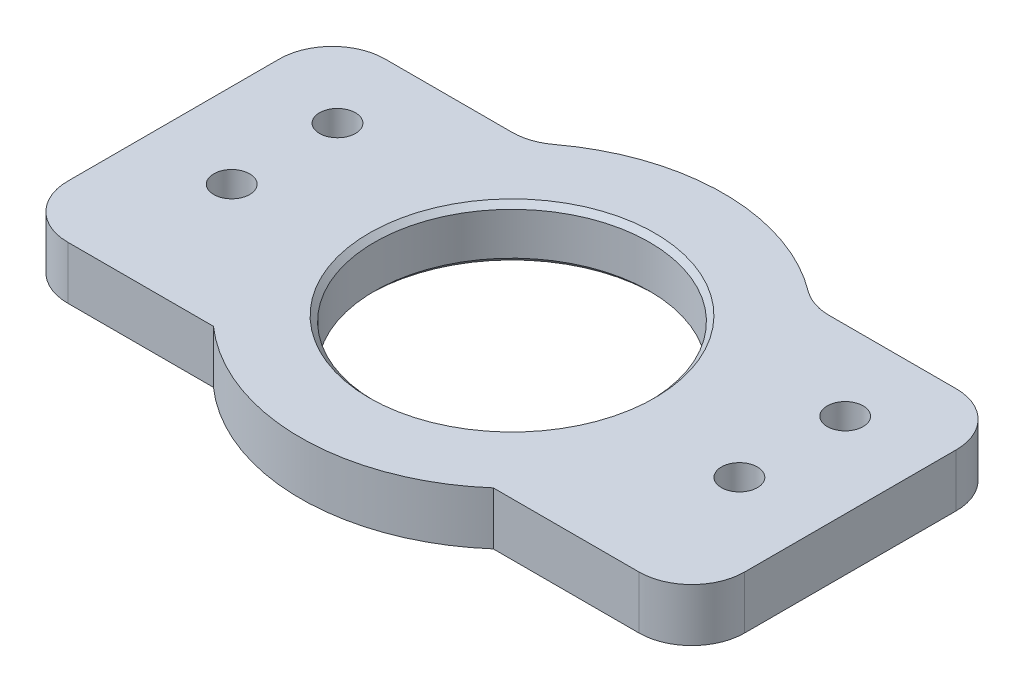
ISO-10303-21;
HEADER;
FILE_DESCRIPTION(('STEP AP214'),'2;1');
FILE_NAME('part.step','',(''),(''),'','','');
FILE_SCHEMA(('AUTOMOTIVE_DESIGN { 1 0 10303 214 1 1 1 1 }'));
ENDSEC;
DATA;
#1=APPLICATION_CONTEXT('core data for automotive mechanical design processes');
#2=APPLICATION_PROTOCOL_DEFINITION('international standard','automotive_design',2000,#1);
#3=PRODUCT_CONTEXT('',#1,'mechanical');
#4=PRODUCT('Part','Part','',(#3));
#5=PRODUCT_RELATED_PRODUCT_CATEGORY('part','',(#4));
#6=PRODUCT_DEFINITION_FORMATION('','',#4);
#7=PRODUCT_DEFINITION_CONTEXT('part definition',#1,'design');
#8=PRODUCT_DEFINITION('design','',#6,#7);
#9=PRODUCT_DEFINITION_SHAPE('','',#8);
#10=(LENGTH_UNIT() NAMED_UNIT(*) SI_UNIT(.MILLI.,.METRE.));
#11=(NAMED_UNIT(*) PLANE_ANGLE_UNIT() SI_UNIT($,.RADIAN.));
#12=(NAMED_UNIT(*) SI_UNIT($,.STERADIAN.) SOLID_ANGLE_UNIT());
#13=UNCERTAINTY_MEASURE_WITH_UNIT(LENGTH_MEASURE(1.E-05),#10,'distance_accuracy_value','');
#14=(GEOMETRIC_REPRESENTATION_CONTEXT(3) GLOBAL_UNCERTAINTY_ASSIGNED_CONTEXT((#13)) GLOBAL_UNIT_ASSIGNED_CONTEXT((#10,
#11,#12)) REPRESENTATION_CONTEXT('',''));
#15=CARTESIAN_POINT('',(0.,0.,0.));
#16=DIRECTION('',(0.,0.,1.));
#17=DIRECTION('',(1.,0.,0.));
#18=AXIS2_PLACEMENT_3D('',#15,#16,#17);
#19=CARTESIAN_POINT('',(0.,5.,0.));
#20=DIRECTION('',(1.,0.,0.));
#21=DIRECTION('',(0.,0.,-1.));
#22=AXIS2_PLACEMENT_3D('',#19,#20,#21);
#23=PLANE('',#22);
#24=DIRECTION('',(0.,0.,1.));
#25=VECTOR('',#24,1.);
#26=CARTESIAN_POINT('',(0.,0.,0.));
#27=LINE('',#26,#25);
#28=CARTESIAN_POINT('',(0.,0.,-25.));
#29=VERTEX_POINT('',#28);
#30=CARTESIAN_POINT('',(0.,0.,-5.));
#31=VERTEX_POINT('',#30);
#32=EDGE_CURVE('E190',#29,#31,#27,.T.);
#33=ORIENTED_EDGE('',*,*,#32,.T.);
#34=DIRECTION('',(0.,-1.,0.));
#35=VECTOR('',#34,1.);
#36=CARTESIAN_POINT('',(0.,5.,-5.));
#37=LINE('',#36,#35);
#38=CARTESIAN_POINT('',(0.,5.,-5.));
#39=VERTEX_POINT('',#38);
#40=EDGE_CURVE('E243',#31,#39,#37,.F.);
#41=ORIENTED_EDGE('',*,*,#40,.T.);
#42=DIRECTION('',(0.,0.,1.));
#43=VECTOR('',#42,1.);
#44=CARTESIAN_POINT('',(0.,5.,0.));
#45=LINE('',#44,#43);
#46=CARTESIAN_POINT('',(0.,5.,-25.));
#47=VERTEX_POINT('',#46);
#48=EDGE_CURVE('E161',#47,#39,#45,.T.);
#49=ORIENTED_EDGE('',*,*,#48,.F.);
#50=DIRECTION('',(0.,-1.,0.));
#51=VECTOR('',#50,1.);
#52=CARTESIAN_POINT('',(0.,5.,-25.));
#53=LINE('',#52,#51);
#54=EDGE_CURVE('E240',#47,#29,#53,.T.);
#55=ORIENTED_EDGE('',*,*,#54,.T.);
#56=EDGE_LOOP('',(#33,#41,#49,#55));
#57=FACE_BOUND('',#56,.T.);
#58=ADVANCED_FACE('F45',(#57),#23,.F.);
#59=CARTESIAN_POINT('',(0.,5.,0.));
#60=DIRECTION('',(0.,0.,-1.));
#61=DIRECTION('',(-1.,0.,0.));
#62=AXIS2_PLACEMENT_3D('',#59,#60,#61);
#63=PLANE('',#62);
#64=DIRECTION('',(1.,0.,0.));
#65=VECTOR('',#64,1.);
#66=CARTESIAN_POINT('',(0.,5.,0.));
#67=LINE('',#66,#65);
#68=CARTESIAN_POINT('',(5.,5.,0.));
#69=VERTEX_POINT('',#68);
#70=CARTESIAN_POINT('',(18.771243444677,5.,0.));
#71=VERTEX_POINT('',#70);
#72=EDGE_CURVE('E147',#69,#71,#67,.T.);
#73=ORIENTED_EDGE('',*,*,#72,.F.);
#74=DIRECTION('',(0.,-1.,0.));
#75=VECTOR('',#74,1.);
#76=CARTESIAN_POINT('',(5.,5.,0.));
#77=LINE('',#76,#75);
#78=CARTESIAN_POINT('',(5.,0.,0.));
#79=VERTEX_POINT('',#78);
#80=EDGE_CURVE('E238',#69,#79,#77,.T.);
#81=ORIENTED_EDGE('',*,*,#80,.T.);
#82=DIRECTION('',(1.,0.,0.));
#83=VECTOR('',#82,1.);
#84=CARTESIAN_POINT('',(0.,0.,0.));
#85=LINE('',#84,#83);
#86=CARTESIAN_POINT('',(18.771243444677,0.,0.));
#87=VERTEX_POINT('',#86);
#88=EDGE_CURVE('E167',#79,#87,#85,.T.);
#89=ORIENTED_EDGE('',*,*,#88,.T.);
#90=DIRECTION('',(0.,-1.,0.));
#91=VECTOR('',#90,1.);
#92=CARTESIAN_POINT('',(18.771243444677,5.,0.));
#93=LINE('',#92,#91);
#94=EDGE_CURVE('E164',#71,#87,#93,.T.);
#95=ORIENTED_EDGE('',*,*,#94,.F.);
#96=EDGE_LOOP('',(#73,#81,#89,#95));
#97=FACE_BOUND('',#96,.T.);
#98=ADVANCED_FACE('F165',(#97),#63,.F.);
#99=CARTESIAN_POINT('',(32.,5.,-15.));
#100=DIRECTION('',(0.,-1.,0.));
#101=DIRECTION('',(0.,0.,-1.));
#102=AXIS2_PLACEMENT_3D('',#99,#100,#101);
#103=CYLINDRICAL_SURFACE('',#102,20.);
#104=CARTESIAN_POINT('',(32.,0.,-15.));
#105=DIRECTION('',(0.,1.,0.));
#106=DIRECTION('',(0.,0.,1.));
#107=AXIS2_PLACEMENT_3D('',#104,#105,#106);
#108=CIRCLE('',#107,20.);
#109=CARTESIAN_POINT('',(45.228756555323,0.,0.));
#110=VERTEX_POINT('',#109);
#111=EDGE_CURVE('E195',#87,#110,#108,.T.);
#112=ORIENTED_EDGE('',*,*,#111,.T.);
#113=DIRECTION('',(0.,-1.,0.));
#114=VECTOR('',#113,1.);
#115=CARTESIAN_POINT('',(45.228756555323,5.,0.));
#116=LINE('',#115,#114);
#117=CARTESIAN_POINT('',(45.228756555323,5.,0.));
#118=VERTEX_POINT('',#117);
#119=EDGE_CURVE('E171',#118,#110,#116,.T.);
#120=ORIENTED_EDGE('',*,*,#119,.F.);
#121=CARTESIAN_POINT('',(32.,5.,-15.));
#122=DIRECTION('',(0.,1.,0.));
#123=DIRECTION('',(0.,0.,1.));
#124=AXIS2_PLACEMENT_3D('',#121,#122,#123);
#125=CIRCLE('',#124,20.);
#126=EDGE_CURVE('E153',#71,#118,#125,.T.);
#127=ORIENTED_EDGE('',*,*,#126,.F.);
#128=ORIENTED_EDGE('',*,*,#94,.T.);
#129=EDGE_LOOP('',(#112,#120,#127,#128));
#130=FACE_BOUND('',#129,.T.);
#131=ADVANCED_FACE('F173',(#130),#103,.T.);
#132=CARTESIAN_POINT('',(45.228756555323,5.,0.));
#133=DIRECTION('',(0.,0.,-1.));
#134=DIRECTION('',(-1.,0.,0.));
#135=AXIS2_PLACEMENT_3D('',#132,#133,#134);
#136=PLANE('',#135);
#137=DIRECTION('',(1.,0.,0.));
#138=VECTOR('',#137,1.);
#139=CARTESIAN_POINT('',(45.228756555323,0.,0.));
#140=LINE('',#139,#138);
#141=CARTESIAN_POINT('',(59.,0.,0.));
#142=VERTEX_POINT('',#141);
#143=EDGE_CURVE('E197',#110,#142,#140,.T.);
#144=ORIENTED_EDGE('',*,*,#143,.T.);
#145=DIRECTION('',(0.,-1.,0.));
#146=VECTOR('',#145,1.);
#147=CARTESIAN_POINT('',(59.,5.,0.));
#148=LINE('',#147,#146);
#149=CARTESIAN_POINT('',(59.,5.,0.));
#150=VERTEX_POINT('',#149);
#151=EDGE_CURVE('E236',#142,#150,#148,.F.);
#152=ORIENTED_EDGE('',*,*,#151,.T.);
#153=DIRECTION('',(1.,0.,0.));
#154=VECTOR('',#153,1.);
#155=CARTESIAN_POINT('',(45.228756555323,5.,0.));
#156=LINE('',#155,#154);
#157=EDGE_CURVE('E176',#118,#150,#156,.T.);
#158=ORIENTED_EDGE('',*,*,#157,.F.);
#159=ORIENTED_EDGE('',*,*,#119,.T.);
#160=EDGE_LOOP('',(#144,#152,#158,#159));
#161=FACE_BOUND('',#160,.T.);
#162=ADVANCED_FACE('F419',(#161),#136,.F.);
#163=CARTESIAN_POINT('',(64.,5.,0.));
#164=DIRECTION('',(-1.,0.,0.));
#165=DIRECTION('',(0.,0.,1.));
#166=AXIS2_PLACEMENT_3D('',#163,#164,#165);
#167=PLANE('',#166);
#168=DIRECTION('',(0.,0.,-1.));
#169=VECTOR('',#168,1.);
#170=CARTESIAN_POINT('',(64.,0.,0.));
#171=LINE('',#170,#169);
#172=CARTESIAN_POINT('',(64.,0.,-5.));
#173=VERTEX_POINT('',#172);
#174=CARTESIAN_POINT('',(64.,0.,-25.));
#175=VERTEX_POINT('',#174);
#176=EDGE_CURVE('E200',#173,#175,#171,.T.);
#177=ORIENTED_EDGE('',*,*,#176,.T.);
#178=DIRECTION('',(0.,-1.,0.));
#179=VECTOR('',#178,1.);
#180=CARTESIAN_POINT('',(64.,5.,-25.));
#181=LINE('',#180,#179);
#182=CARTESIAN_POINT('',(64.,5.,-25.));
#183=VERTEX_POINT('',#182);
#184=EDGE_CURVE('E227',#175,#183,#181,.F.);
#185=ORIENTED_EDGE('',*,*,#184,.T.);
#186=DIRECTION('',(0.,0.,-1.));
#187=VECTOR('',#186,1.);
#188=CARTESIAN_POINT('',(64.,5.,0.));
#189=LINE('',#188,#187);
#190=CARTESIAN_POINT('',(64.,5.,-5.));
#191=VERTEX_POINT('',#190);
#192=EDGE_CURVE('E178',#191,#183,#189,.T.);
#193=ORIENTED_EDGE('',*,*,#192,.F.);
#194=DIRECTION('',(0.,-1.,0.));
#195=VECTOR('',#194,1.);
#196=CARTESIAN_POINT('',(64.,5.,-5.));
#197=LINE('',#196,#195);
#198=EDGE_CURVE('E224',#191,#173,#197,.T.);
#199=ORIENTED_EDGE('',*,*,#198,.T.);
#200=EDGE_LOOP('',(#177,#185,#193,#199));
#201=FACE_BOUND('',#200,.T.);
#202=ADVANCED_FACE('F416',(#201),#167,.F.);
#203=CARTESIAN_POINT('',(45.228756555323,5.,-30.));
#204=DIRECTION('',(0.,0.,1.));
#205=DIRECTION('',(1.,0.,0.));
#206=AXIS2_PLACEMENT_3D('',#203,#204,#205);
#207=PLANE('',#206);
#208=DIRECTION('',(-1.,0.,0.));
#209=VECTOR('',#208,1.);
#210=CARTESIAN_POINT('',(45.228756555323,5.,-30.));
#211=LINE('',#210,#209);
#212=CARTESIAN_POINT('',(59.,5.,-30.));
#213=VERTEX_POINT('',#212);
#214=CARTESIAN_POINT('',(47.,5.,-30.));
#215=VERTEX_POINT('',#214);
#216=EDGE_CURVE('E183',#213,#215,#211,.T.);
#217=ORIENTED_EDGE('',*,*,#216,.F.);
#218=DIRECTION('',(0.,-1.,0.));
#219=VECTOR('',#218,1.);
#220=CARTESIAN_POINT('',(59.,5.,-30.));
#221=LINE('',#220,#219);
#222=CARTESIAN_POINT('',(59.,0.,-30.));
#223=VERTEX_POINT('',#222);
#224=EDGE_CURVE('E213',#213,#223,#221,.T.);
#225=ORIENTED_EDGE('',*,*,#224,.T.);
#226=DIRECTION('',(-1.,0.,0.));
#227=VECTOR('',#226,1.);
#228=CARTESIAN_POINT('',(45.228756555323,0.,-30.));
#229=LINE('',#228,#227);
#230=CARTESIAN_POINT('',(47.,0.,-30.));
#231=VERTEX_POINT('',#230);
#232=EDGE_CURVE('E203',#223,#231,#229,.T.);
#233=ORIENTED_EDGE('',*,*,#232,.T.);
#234=DIRECTION('',(0.,1.,0.));
#235=VECTOR('',#234,1.);
#236=CARTESIAN_POINT('',(47.,5.,-30.));
#237=LINE('',#236,#235);
#238=EDGE_CURVE('E170',#231,#215,#237,.T.);
#239=ORIENTED_EDGE('',*,*,#238,.T.);
#240=EDGE_LOOP('',(#217,#225,#233,#239));
#241=FACE_BOUND('',#240,.T.);
#242=ADVANCED_FACE('F314',(#241),#207,.F.);
#243=CARTESIAN_POINT('',(32.,5.,-15.));
#244=DIRECTION('',(0.,-1.,0.));
#245=DIRECTION('',(0.,0.,-1.));
#246=AXIS2_PLACEMENT_3D('',#243,#244,#245);
#247=CYLINDRICAL_SURFACE('',#246,20.);
#248=CARTESIAN_POINT('',(32.,5.,-15.));
#249=DIRECTION('',(0.,1.,0.));
#250=DIRECTION('',(0.,0.,1.));
#251=AXIS2_PLACEMENT_3D('',#248,#249,#250);
#252=CIRCLE('',#251,20.);
#253=CARTESIAN_POINT('',(44.,5.,-31.));
#254=VERTEX_POINT('',#253);
#255=CARTESIAN_POINT('',(20.,5.,-31.));
#256=VERTEX_POINT('',#255);
#257=EDGE_CURVE('E186',#254,#256,#252,.T.);
#258=ORIENTED_EDGE('',*,*,#257,.F.);
#259=DIRECTION('',(0.,-1.,0.));
#260=VECTOR('',#259,1.);
#261=CARTESIAN_POINT('',(44.,5.,-31.));
#262=LINE('',#261,#260);
#263=CARTESIAN_POINT('',(44.,0.,-31.));
#264=VERTEX_POINT('',#263);
#265=EDGE_CURVE('E251',#254,#264,#262,.T.);
#266=ORIENTED_EDGE('',*,*,#265,.T.);
#267=CARTESIAN_POINT('',(32.,0.,-15.));
#268=DIRECTION('',(0.,1.,0.));
#269=DIRECTION('',(0.,0.,1.));
#270=AXIS2_PLACEMENT_3D('',#267,#268,#269);
#271=CIRCLE('',#270,20.);
#272=CARTESIAN_POINT('',(20.,0.,-31.));
#273=VERTEX_POINT('',#272);
#274=EDGE_CURVE('E206',#264,#273,#271,.T.);
#275=ORIENTED_EDGE('',*,*,#274,.T.);
#276=DIRECTION('',(0.,-1.,0.));
#277=VECTOR('',#276,1.);
#278=CARTESIAN_POINT('',(20.,5.,-31.));
#279=LINE('',#278,#277);
#280=EDGE_CURVE('E249',#273,#256,#279,.F.);
#281=ORIENTED_EDGE('',*,*,#280,.T.);
#282=EDGE_LOOP('',(#258,#266,#275,#281));
#283=FACE_BOUND('',#282,.T.);
#284=ADVANCED_FACE('F322',(#283),#247,.T.);
#285=CARTESIAN_POINT('',(0.,5.,-30.));
#286=DIRECTION('',(0.,0.,1.));
#287=DIRECTION('',(1.,0.,0.));
#288=AXIS2_PLACEMENT_3D('',#285,#286,#287);
#289=PLANE('',#288);
#290=DIRECTION('',(-1.,0.,0.));
#291=VECTOR('',#290,1.);
#292=CARTESIAN_POINT('',(0.,0.,-30.));
#293=LINE('',#292,#291);
#294=CARTESIAN_POINT('',(17.,0.,-30.));
#295=VERTEX_POINT('',#294);
#296=CARTESIAN_POINT('',(5.,0.,-30.));
#297=VERTEX_POINT('',#296);
#298=EDGE_CURVE('E209',#295,#297,#293,.T.);
#299=ORIENTED_EDGE('',*,*,#298,.T.);
#300=DIRECTION('',(0.,-1.,0.));
#301=VECTOR('',#300,1.);
#302=CARTESIAN_POINT('',(5.,5.,-30.));
#303=LINE('',#302,#301);
#304=CARTESIAN_POINT('',(5.,5.,-30.));
#305=VERTEX_POINT('',#304);
#306=EDGE_CURVE('E61',#297,#305,#303,.F.);
#307=ORIENTED_EDGE('',*,*,#306,.T.);
#308=DIRECTION('',(-1.,0.,0.));
#309=VECTOR('',#308,1.);
#310=CARTESIAN_POINT('',(0.,5.,-30.));
#311=LINE('',#310,#309);
#312=CARTESIAN_POINT('',(17.,5.,-30.));
#313=VERTEX_POINT('',#312);
#314=EDGE_CURVE('E188',#313,#305,#311,.T.);
#315=ORIENTED_EDGE('',*,*,#314,.F.);
#316=DIRECTION('',(0.,1.,0.));
#317=VECTOR('',#316,1.);
#318=CARTESIAN_POINT('',(17.,0.,-30.));
#319=LINE('',#318,#317);
#320=EDGE_CURVE('E245',#313,#295,#319,.F.);
#321=ORIENTED_EDGE('',*,*,#320,.T.);
#322=EDGE_LOOP('',(#299,#307,#315,#321));
#323=FACE_BOUND('',#322,.T.);
#324=ADVANCED_FACE('F328',(#323),#289,.F.);
#325=CARTESIAN_POINT('',(32.,5.,-15.));
#326=DIRECTION('',(0.,1.,0.));
#327=DIRECTION('',(0.,0.,1.));
#328=AXIS2_PLACEMENT_3D('',#325,#326,#327);
#329=PLANE('',#328);
#330=CARTESIAN_POINT('',(32.,5.,-15.));
#331=DIRECTION('',(0.,1.,0.));
#332=DIRECTION('',(0.,0.,1.));
#333=AXIS2_PLACEMENT_3D('',#330,#331,#332);
#334=CIRCLE('',#333,13.5);
#335=CARTESIAN_POINT('',(32.,5.,-1.49999999999998));
#336=VERTEX_POINT('',#335);
#337=EDGE_CURVE('E54',#336,#336,#334,.F.);
#338=ORIENTED_EDGE('',*,*,#337,.T.);
#339=EDGE_LOOP('',(#338));
#340=FACE_BOUND('',#339,.T.);
#341=CARTESIAN_POINT('',(56.0000000000005,5.,-22.5000000000002));
#342=DIRECTION('',(0.,-1.,0.));
#343=DIRECTION('',(0.,0.,-1.));
#344=AXIS2_PLACEMENT_3D('',#341,#342,#343);
#345=CIRCLE('',#344,1.69999999999999);
#346=CARTESIAN_POINT('',(56.0000000000005,5.,-24.2000000000002));
#347=VERTEX_POINT('',#346);
#348=EDGE_CURVE('E349',#347,#347,#345,.T.);
#349=ORIENTED_EDGE('',*,*,#348,.T.);
#350=EDGE_LOOP('',(#349));
#351=FACE_BOUND('',#350,.T.);
#352=CARTESIAN_POINT('',(56.0000000000005,5.,-12.5000000000002));
#353=DIRECTION('',(0.,-1.,0.));
#354=DIRECTION('',(0.,0.,-1.));
#355=AXIS2_PLACEMENT_3D('',#352,#353,#354);
#356=CIRCLE('',#355,1.69999999999999);
#357=CARTESIAN_POINT('',(56.0000000000005,5.,-14.2000000000002));
#358=VERTEX_POINT('',#357);
#359=EDGE_CURVE('E345',#358,#358,#356,.T.);
#360=ORIENTED_EDGE('',*,*,#359,.T.);
#361=EDGE_LOOP('',(#360));
#362=FACE_BOUND('',#361,.T.);
#363=CARTESIAN_POINT('',(7.9999999999999,5.,-22.4999999999998));
#364=DIRECTION('',(0.,-1.,0.));
#365=DIRECTION('',(0.,0.,-1.));
#366=AXIS2_PLACEMENT_3D('',#363,#364,#365);
#367=CIRCLE('',#366,1.69999999999999);
#368=CARTESIAN_POINT('',(7.9999999999999,5.,-24.1999999999998));
#369=VERTEX_POINT('',#368);
#370=EDGE_CURVE('E341',#369,#369,#367,.T.);
#371=ORIENTED_EDGE('',*,*,#370,.T.);
#372=EDGE_LOOP('',(#371));
#373=FACE_BOUND('',#372,.T.);
#374=CARTESIAN_POINT('',(7.99999999999991,5.,-12.4999999999998));
#375=DIRECTION('',(0.,-1.,0.));
#376=DIRECTION('',(0.,0.,-1.));
#377=AXIS2_PLACEMENT_3D('',#374,#375,#376);
#378=CIRCLE('',#377,1.69999999999999);
#379=CARTESIAN_POINT('',(7.99999999999991,5.,-14.1999999999998));
#380=VERTEX_POINT('',#379);
#381=EDGE_CURVE('E193',#380,#380,#378,.T.);
#382=ORIENTED_EDGE('',*,*,#381,.T.);
#383=EDGE_LOOP('',(#382));
#384=FACE_BOUND('',#383,.T.);
#385=ORIENTED_EDGE('',*,*,#192,.T.);
#386=CARTESIAN_POINT('',(59.,5.,-25.));
#387=DIRECTION('',(0.,1.,0.));
#388=DIRECTION('',(0.,0.,1.));
#389=AXIS2_PLACEMENT_3D('',#386,#387,#388);
#390=CIRCLE('',#389,5.);
#391=EDGE_CURVE('E234',#183,#213,#390,.T.);
#392=ORIENTED_EDGE('',*,*,#391,.T.);
#393=ORIENTED_EDGE('',*,*,#216,.T.);
#394=CARTESIAN_POINT('',(47.,5.,-35.));
#395=DIRECTION('',(0.,1.,0.));
#396=DIRECTION('',(0.,0.,1.));
#397=AXIS2_PLACEMENT_3D('',#394,#395,#396);
#398=CIRCLE('',#397,5.);
#399=EDGE_CURVE('E256',#215,#254,#398,.F.);
#400=ORIENTED_EDGE('',*,*,#399,.T.);
#401=ORIENTED_EDGE('',*,*,#257,.T.);
#402=CARTESIAN_POINT('',(17.,5.,-35.));
#403=DIRECTION('',(0.,1.,0.));
#404=DIRECTION('',(0.,0.,1.));
#405=AXIS2_PLACEMENT_3D('',#402,#403,#404);
#406=CIRCLE('',#405,5.);
#407=EDGE_CURVE('E68',#256,#313,#406,.F.);
#408=ORIENTED_EDGE('',*,*,#407,.T.);
#409=ORIENTED_EDGE('',*,*,#314,.T.);
#410=CARTESIAN_POINT('',(5.,5.,-25.));
#411=DIRECTION('',(0.,1.,0.));
#412=DIRECTION('',(0.,0.,1.));
#413=AXIS2_PLACEMENT_3D('',#410,#411,#412);
#414=CIRCLE('',#413,5.);
#415=EDGE_CURVE('E229',#305,#47,#414,.T.);
#416=ORIENTED_EDGE('',*,*,#415,.T.);
#417=ORIENTED_EDGE('',*,*,#48,.T.);
#418=CARTESIAN_POINT('',(5.,5.,-5.));
#419=DIRECTION('',(0.,1.,0.));
#420=DIRECTION('',(0.,0.,1.));
#421=AXIS2_PLACEMENT_3D('',#418,#419,#420);
#422=CIRCLE('',#421,5.);
#423=EDGE_CURVE('E157',#39,#69,#422,.T.);
#424=ORIENTED_EDGE('',*,*,#423,.T.);
#425=ORIENTED_EDGE('',*,*,#72,.T.);
#426=ORIENTED_EDGE('',*,*,#126,.T.);
#427=ORIENTED_EDGE('',*,*,#157,.T.);
#428=CARTESIAN_POINT('',(59.,5.,-5.));
#429=DIRECTION('',(0.,1.,0.));
#430=DIRECTION('',(0.,0.,1.));
#431=AXIS2_PLACEMENT_3D('',#428,#429,#430);
#432=CIRCLE('',#431,5.);
#433=EDGE_CURVE('E232',#150,#191,#432,.T.);
#434=ORIENTED_EDGE('',*,*,#433,.T.);
#435=EDGE_LOOP('',(#385,#392,#393,#400,#401,#408,#409,#416,#417,#424,#425,#426,#427,#434));
#436=FACE_BOUND('',#435,.T.);
#437=ADVANCED_FACE('F150',(#340,#351,#362,#373,#384,#436),#329,.T.);
#438=CARTESIAN_POINT('',(32.,0.,-15.));
#439=DIRECTION('',(0.,1.,0.));
#440=DIRECTION('',(0.,0.,1.));
#441=AXIS2_PLACEMENT_3D('',#438,#439,#440);
#442=PLANE('',#441);
#443=CARTESIAN_POINT('',(32.,0.,-15.));
#444=DIRECTION('',(0.,1.,0.));
#445=DIRECTION('',(0.,0.,1.));
#446=AXIS2_PLACEMENT_3D('',#443,#444,#445);
#447=CIRCLE('',#446,13.5);
#448=CARTESIAN_POINT('',(32.,0.,-1.5));
#449=VERTEX_POINT('',#448);
#450=EDGE_CURVE('E11',#449,#449,#447,.T.);
#451=ORIENTED_EDGE('',*,*,#450,.T.);
#452=EDGE_LOOP('',(#451));
#453=FACE_BOUND('',#452,.T.);
#454=CARTESIAN_POINT('',(56.0000000000005,0.,-22.5000000000002));
#455=DIRECTION('',(0.,-1.,0.));
#456=DIRECTION('',(0.,0.,-1.));
#457=AXIS2_PLACEMENT_3D('',#454,#455,#456);
#458=CIRCLE('',#457,1.69999999999999);
#459=CARTESIAN_POINT('',(56.0000000000005,0.,-24.2000000000002));
#460=VERTEX_POINT('',#459);
#461=EDGE_CURVE('E295',#460,#460,#458,.T.);
#462=ORIENTED_EDGE('',*,*,#461,.F.);
#463=EDGE_LOOP('',(#462));
#464=FACE_BOUND('',#463,.T.);
#465=CARTESIAN_POINT('',(56.0000000000005,0.,-12.5000000000002));
#466=DIRECTION('',(0.,-1.,0.));
#467=DIRECTION('',(0.,0.,-1.));
#468=AXIS2_PLACEMENT_3D('',#465,#466,#467);
#469=CIRCLE('',#468,1.69999999999999);
#470=CARTESIAN_POINT('',(56.0000000000005,0.,-14.2000000000002));
#471=VERTEX_POINT('',#470);
#472=EDGE_CURVE('E299',#471,#471,#469,.T.);
#473=ORIENTED_EDGE('',*,*,#472,.F.);
#474=EDGE_LOOP('',(#473));
#475=FACE_BOUND('',#474,.T.);
#476=CARTESIAN_POINT('',(7.9999999999999,0.,-22.4999999999998));
#477=DIRECTION('',(0.,-1.,0.));
#478=DIRECTION('',(0.,0.,-1.));
#479=AXIS2_PLACEMENT_3D('',#476,#477,#478);
#480=CIRCLE('',#479,1.69999999999999);
#481=CARTESIAN_POINT('',(7.9999999999999,0.,-24.1999999999998));
#482=VERTEX_POINT('',#481);
#483=EDGE_CURVE('E303',#482,#482,#480,.T.);
#484=ORIENTED_EDGE('',*,*,#483,.F.);
#485=EDGE_LOOP('',(#484));
#486=FACE_BOUND('',#485,.T.);
#487=CARTESIAN_POINT('',(7.99999999999991,0.,-12.4999999999998));
#488=DIRECTION('',(0.,-1.,0.));
#489=DIRECTION('',(0.,0.,-1.));
#490=AXIS2_PLACEMENT_3D('',#487,#488,#489);
#491=CIRCLE('',#490,1.69999999999999);
#492=CARTESIAN_POINT('',(7.99999999999991,0.,-14.1999999999998));
#493=VERTEX_POINT('',#492);
#494=EDGE_CURVE('E307',#493,#493,#491,.T.);
#495=ORIENTED_EDGE('',*,*,#494,.F.);
#496=EDGE_LOOP('',(#495));
#497=FACE_BOUND('',#496,.T.);
#498=ORIENTED_EDGE('',*,*,#232,.F.);
#499=CARTESIAN_POINT('',(59.,0.,-25.));
#500=DIRECTION('',(0.,1.,0.));
#501=DIRECTION('',(0.,0.,1.));
#502=AXIS2_PLACEMENT_3D('',#499,#500,#501);
#503=CIRCLE('',#502,5.);
#504=EDGE_CURVE('E222',#223,#175,#503,.F.);
#505=ORIENTED_EDGE('',*,*,#504,.T.);
#506=ORIENTED_EDGE('',*,*,#176,.F.);
#507=CARTESIAN_POINT('',(59.,0.,-5.));
#508=DIRECTION('',(0.,1.,0.));
#509=DIRECTION('',(0.,0.,1.));
#510=AXIS2_PLACEMENT_3D('',#507,#508,#509);
#511=CIRCLE('',#510,5.);
#512=EDGE_CURVE('E220',#173,#142,#511,.F.);
#513=ORIENTED_EDGE('',*,*,#512,.T.);
#514=ORIENTED_EDGE('',*,*,#143,.F.);
#515=ORIENTED_EDGE('',*,*,#111,.F.);
#516=ORIENTED_EDGE('',*,*,#88,.F.);
#517=CARTESIAN_POINT('',(5.,0.,-5.));
#518=DIRECTION('',(0.,1.,0.));
#519=DIRECTION('',(0.,0.,1.));
#520=AXIS2_PLACEMENT_3D('',#517,#518,#519);
#521=CIRCLE('',#520,5.);
#522=EDGE_CURVE('E218',#79,#31,#521,.F.);
#523=ORIENTED_EDGE('',*,*,#522,.T.);
#524=ORIENTED_EDGE('',*,*,#32,.F.);
#525=CARTESIAN_POINT('',(5.,0.,-25.));
#526=DIRECTION('',(0.,1.,0.));
#527=DIRECTION('',(0.,0.,1.));
#528=AXIS2_PLACEMENT_3D('',#525,#526,#527);
#529=CIRCLE('',#528,5.);
#530=EDGE_CURVE('E216',#29,#297,#529,.F.);
#531=ORIENTED_EDGE('',*,*,#530,.T.);
#532=ORIENTED_EDGE('',*,*,#298,.F.);
#533=CARTESIAN_POINT('',(17.,0.,-35.));
#534=DIRECTION('',(0.,1.,0.));
#535=DIRECTION('',(0.,0.,1.));
#536=AXIS2_PLACEMENT_3D('',#533,#534,#535);
#537=CIRCLE('',#536,5.);
#538=EDGE_CURVE('E258',#295,#273,#537,.T.);
#539=ORIENTED_EDGE('',*,*,#538,.T.);
#540=ORIENTED_EDGE('',*,*,#274,.F.);
#541=CARTESIAN_POINT('',(47.,0.,-35.));
#542=DIRECTION('',(0.,1.,0.));
#543=DIRECTION('',(0.,0.,1.));
#544=AXIS2_PLACEMENT_3D('',#541,#542,#543);
#545=CIRCLE('',#544,5.);
#546=EDGE_CURVE('E254',#264,#231,#545,.T.);
#547=ORIENTED_EDGE('',*,*,#546,.T.);
#548=EDGE_LOOP('',(#498,#505,#506,#513,#514,#515,#516,#523,#524,#531,#532,#539,#540,#547));
#549=FACE_BOUND('',#548,.T.);
#550=ADVANCED_FACE('F281',(#453,#464,#475,#486,#497,#549),#442,.F.);
#551=CARTESIAN_POINT('',(32.,0.,-15.));
#552=DIRECTION('',(0.,1.,0.));
#553=DIRECTION('',(0.,0.,1.));
#554=AXIS2_PLACEMENT_3D('',#551,#552,#553);
#555=CYLINDRICAL_SURFACE('',#554,13.);
#556=CARTESIAN_POINT('',(32.,4.49999999999999,-15.));
#557=DIRECTION('',(0.,1.,0.));
#558=DIRECTION('',(0.,0.,1.));
#559=AXIS2_PLACEMENT_3D('',#556,#557,#558);
#560=CIRCLE('',#559,13.);
#561=CARTESIAN_POINT('',(32.,4.49999999999999,-2.));
#562=VERTEX_POINT('',#561);
#563=EDGE_CURVE('E264',#562,#562,#560,.T.);
#564=ORIENTED_EDGE('',*,*,#563,.T.);
#565=EDGE_LOOP('',(#564));
#566=FACE_BOUND('',#565,.T.);
#567=CARTESIAN_POINT('',(32.,0.500000000000009,-15.));
#568=DIRECTION('',(0.,1.,0.));
#569=DIRECTION('',(0.,0.,1.));
#570=AXIS2_PLACEMENT_3D('',#567,#568,#569);
#571=CIRCLE('',#570,13.);
#572=CARTESIAN_POINT('',(32.,0.500000000000009,-2.));
#573=VERTEX_POINT('',#572);
#574=EDGE_CURVE('E261',#573,#573,#571,.F.);
#575=ORIENTED_EDGE('',*,*,#574,.T.);
#576=EDGE_LOOP('',(#575));
#577=FACE_BOUND('',#576,.T.);
#578=ADVANCED_FACE('F277',(#566,#577),#555,.F.);
#579=CARTESIAN_POINT('',(59.,5.,-25.));
#580=DIRECTION('',(0.,-1.,0.));
#581=DIRECTION('',(0.,0.,-1.));
#582=AXIS2_PLACEMENT_3D('',#579,#580,#581);
#583=CYLINDRICAL_SURFACE('',#582,5.);
#584=ORIENTED_EDGE('',*,*,#391,.F.);
#585=ORIENTED_EDGE('',*,*,#184,.F.);
#586=ORIENTED_EDGE('',*,*,#504,.F.);
#587=ORIENTED_EDGE('',*,*,#224,.F.);
#588=EDGE_LOOP('',(#584,#585,#586,#587));
#589=FACE_BOUND('',#588,.T.);
#590=ADVANCED_FACE('F280',(#589),#583,.T.);
#591=CARTESIAN_POINT('',(59.,5.,-5.));
#592=DIRECTION('',(0.,-1.,0.));
#593=DIRECTION('',(0.,0.,-1.));
#594=AXIS2_PLACEMENT_3D('',#591,#592,#593);
#595=CYLINDRICAL_SURFACE('',#594,5.);
#596=ORIENTED_EDGE('',*,*,#433,.F.);
#597=ORIENTED_EDGE('',*,*,#151,.F.);
#598=ORIENTED_EDGE('',*,*,#512,.F.);
#599=ORIENTED_EDGE('',*,*,#198,.F.);
#600=EDGE_LOOP('',(#596,#597,#598,#599));
#601=FACE_BOUND('',#600,.T.);
#602=ADVANCED_FACE('F376',(#601),#595,.T.);
#603=CARTESIAN_POINT('',(5.,5.,-5.));
#604=DIRECTION('',(0.,-1.,0.));
#605=DIRECTION('',(0.,0.,-1.));
#606=AXIS2_PLACEMENT_3D('',#603,#604,#605);
#607=CYLINDRICAL_SURFACE('',#606,5.);
#608=ORIENTED_EDGE('',*,*,#423,.F.);
#609=ORIENTED_EDGE('',*,*,#40,.F.);
#610=ORIENTED_EDGE('',*,*,#522,.F.);
#611=ORIENTED_EDGE('',*,*,#80,.F.);
#612=EDGE_LOOP('',(#608,#609,#610,#611));
#613=FACE_BOUND('',#612,.T.);
#614=ADVANCED_FACE('F380',(#613),#607,.T.);
#615=CARTESIAN_POINT('',(5.,5.,-25.));
#616=DIRECTION('',(0.,-1.,0.));
#617=DIRECTION('',(0.,0.,-1.));
#618=AXIS2_PLACEMENT_3D('',#615,#616,#617);
#619=CYLINDRICAL_SURFACE('',#618,5.);
#620=ORIENTED_EDGE('',*,*,#415,.F.);
#621=ORIENTED_EDGE('',*,*,#306,.F.);
#622=ORIENTED_EDGE('',*,*,#530,.F.);
#623=ORIENTED_EDGE('',*,*,#54,.F.);
#624=EDGE_LOOP('',(#620,#621,#622,#623));
#625=FACE_BOUND('',#624,.T.);
#626=ADVANCED_FACE('F333',(#625),#619,.T.);
#627=CARTESIAN_POINT('',(47.,5.,-35.));
#628=DIRECTION('',(0.,-1.,0.));
#629=DIRECTION('',(0.,0.,-1.));
#630=AXIS2_PLACEMENT_3D('',#627,#628,#629);
#631=CYLINDRICAL_SURFACE('',#630,5.);
#632=ORIENTED_EDGE('',*,*,#399,.F.);
#633=ORIENTED_EDGE('',*,*,#238,.F.);
#634=ORIENTED_EDGE('',*,*,#546,.F.);
#635=ORIENTED_EDGE('',*,*,#265,.F.);
#636=EDGE_LOOP('',(#632,#633,#634,#635));
#637=FACE_BOUND('',#636,.T.);
#638=ADVANCED_FACE('F318',(#637),#631,.F.);
#639=CARTESIAN_POINT('',(17.,5.,-35.));
#640=DIRECTION('',(0.,-1.,0.));
#641=DIRECTION('',(0.,0.,-1.));
#642=AXIS2_PLACEMENT_3D('',#639,#640,#641);
#643=CYLINDRICAL_SURFACE('',#642,5.);
#644=ORIENTED_EDGE('',*,*,#407,.F.);
#645=ORIENTED_EDGE('',*,*,#280,.F.);
#646=ORIENTED_EDGE('',*,*,#538,.F.);
#647=ORIENTED_EDGE('',*,*,#320,.F.);
#648=EDGE_LOOP('',(#644,#645,#646,#647));
#649=FACE_BOUND('',#648,.T.);
#650=ADVANCED_FACE('F325',(#649),#643,.F.);
#651=CARTESIAN_POINT('',(7.99999999999991,0.,-12.4999999999998));
#652=DIRECTION('',(0.,-1.,0.));
#653=DIRECTION('',(0.,0.,-1.));
#654=AXIS2_PLACEMENT_3D('',#651,#652,#653);
#655=CYLINDRICAL_SURFACE('',#654,1.69999999999999);
#656=ORIENTED_EDGE('',*,*,#381,.F.);
#657=EDGE_LOOP('',(#656));
#658=FACE_BOUND('',#657,.T.);
#659=ORIENTED_EDGE('',*,*,#494,.T.);
#660=EDGE_LOOP('',(#659));
#661=FACE_BOUND('',#660,.T.);
#662=ADVANCED_FACE('F390',(#658,#661),#655,.F.);
#663=CARTESIAN_POINT('',(7.9999999999999,0.,-22.4999999999998));
#664=DIRECTION('',(0.,-1.,0.));
#665=DIRECTION('',(0.,0.,-1.));
#666=AXIS2_PLACEMENT_3D('',#663,#664,#665);
#667=CYLINDRICAL_SURFACE('',#666,1.69999999999999);
#668=ORIENTED_EDGE('',*,*,#370,.F.);
#669=EDGE_LOOP('',(#668));
#670=FACE_BOUND('',#669,.T.);
#671=ORIENTED_EDGE('',*,*,#483,.T.);
#672=EDGE_LOOP('',(#671));
#673=FACE_BOUND('',#672,.T.);
#674=ADVANCED_FACE('F361',(#670,#673),#667,.F.);
#675=CARTESIAN_POINT('',(56.0000000000005,0.,-12.5000000000002));
#676=DIRECTION('',(0.,-1.,0.));
#677=DIRECTION('',(0.,0.,-1.));
#678=AXIS2_PLACEMENT_3D('',#675,#676,#677);
#679=CYLINDRICAL_SURFACE('',#678,1.69999999999999);
#680=ORIENTED_EDGE('',*,*,#359,.F.);
#681=EDGE_LOOP('',(#680));
#682=FACE_BOUND('',#681,.T.);
#683=ORIENTED_EDGE('',*,*,#472,.T.);
#684=EDGE_LOOP('',(#683));
#685=FACE_BOUND('',#684,.T.);
#686=ADVANCED_FACE('F354',(#682,#685),#679,.F.);
#687=CARTESIAN_POINT('',(56.0000000000005,0.,-22.5000000000002));
#688=DIRECTION('',(0.,-1.,0.));
#689=DIRECTION('',(0.,0.,-1.));
#690=AXIS2_PLACEMENT_3D('',#687,#688,#689);
#691=CYLINDRICAL_SURFACE('',#690,1.69999999999999);
#692=ORIENTED_EDGE('',*,*,#348,.F.);
#693=EDGE_LOOP('',(#692));
#694=FACE_BOUND('',#693,.T.);
#695=ORIENTED_EDGE('',*,*,#461,.T.);
#696=EDGE_LOOP('',(#695));
#697=FACE_BOUND('',#696,.T.);
#698=ADVANCED_FACE('F274',(#694,#697),#691,.F.);
#699=CARTESIAN_POINT('',(32.,4.49999999999999,-15.));
#700=DIRECTION('',(0.,1.,0.));
#701=DIRECTION('',(0.,0.,1.));
#702=AXIS2_PLACEMENT_3D('',#699,#700,#701);
#703=CONICAL_SURFACE('',#702,13.,0.785398163397453);
#704=ORIENTED_EDGE('',*,*,#337,.F.);
#705=EDGE_LOOP('',(#704));
#706=FACE_BOUND('',#705,.T.);
#707=ORIENTED_EDGE('',*,*,#563,.F.);
#708=EDGE_LOOP('',(#707));
#709=FACE_BOUND('',#708,.T.);
#710=ADVANCED_FACE('F271',(#706,#709),#703,.F.);
#711=CARTESIAN_POINT('',(32.,0.,-15.));
#712=DIRECTION('',(0.,-1.,0.));
#713=DIRECTION('',(0.,0.,-1.));
#714=AXIS2_PLACEMENT_3D('',#711,#712,#713);
#715=CONICAL_SURFACE('',#714,13.5,0.785398163397436);
#716=ORIENTED_EDGE('',*,*,#574,.F.);
#717=EDGE_LOOP('',(#716));
#718=FACE_BOUND('',#717,.T.);
#719=ORIENTED_EDGE('',*,*,#450,.F.);
#720=EDGE_LOOP('',(#719));
#721=FACE_BOUND('',#720,.T.);
#722=ADVANCED_FACE('F48',(#718,#721),#715,.F.);
#723=CLOSED_SHELL('',(#58,#98,#131,#162,#202,#242,#284,#324,#437,#550,#578,#590,#602,#614,#626,
#638,#650,#662,#674,#686,#698,#710,#722));
#724=MANIFOLD_SOLID_BREP('B2',#723);
#725=ADVANCED_BREP_SHAPE_REPRESENTATION('',(#18,#724),#14);
#726=SHAPE_DEFINITION_REPRESENTATION(#9,#725);
ENDSEC;
END-ISO-10303-21;
